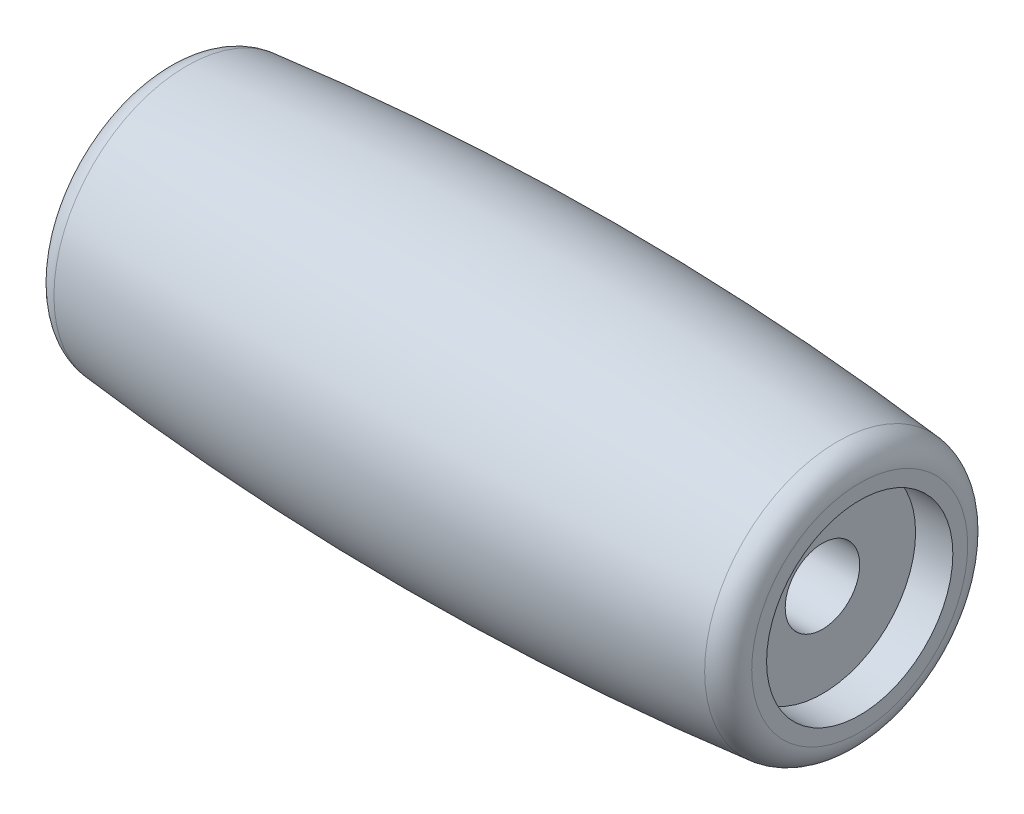
ISO-10303-21;
HEADER;
FILE_DESCRIPTION(('STEP AP214'),'2;1');
FILE_NAME('part.step','',(''),(''),'','','');
FILE_SCHEMA(('AUTOMOTIVE_DESIGN { 1 0 10303 214 1 1 1 1 }'));
ENDSEC;
DATA;
#1=APPLICATION_CONTEXT('core data for automotive mechanical design processes');
#2=APPLICATION_PROTOCOL_DEFINITION('international standard','automotive_design',2000,#1);
#3=PRODUCT_CONTEXT('',#1,'mechanical');
#4=PRODUCT('Part','Part','',(#3));
#5=PRODUCT_RELATED_PRODUCT_CATEGORY('part','',(#4));
#6=PRODUCT_DEFINITION_FORMATION('','',#4);
#7=PRODUCT_DEFINITION_CONTEXT('part definition',#1,'design');
#8=PRODUCT_DEFINITION('design','',#6,#7);
#9=PRODUCT_DEFINITION_SHAPE('','',#8);
#10=(LENGTH_UNIT() NAMED_UNIT(*) SI_UNIT(.MILLI.,.METRE.));
#11=(NAMED_UNIT(*) PLANE_ANGLE_UNIT() SI_UNIT($,.RADIAN.));
#12=(NAMED_UNIT(*) SI_UNIT($,.STERADIAN.) SOLID_ANGLE_UNIT());
#13=UNCERTAINTY_MEASURE_WITH_UNIT(LENGTH_MEASURE(1.E-05),#10,'distance_accuracy_value','');
#14=(GEOMETRIC_REPRESENTATION_CONTEXT(3) GLOBAL_UNCERTAINTY_ASSIGNED_CONTEXT((#13)) GLOBAL_UNIT_ASSIGNED_CONTEXT((#10,
#11,#12)) REPRESENTATION_CONTEXT('',''));
#15=CARTESIAN_POINT('',(0.,0.,0.));
#16=DIRECTION('',(0.,0.,1.));
#17=DIRECTION('',(1.,0.,0.));
#18=AXIS2_PLACEMENT_3D('',#15,#16,#17);
#19=CARTESIAN_POINT('',(28.,2.43438778166371E-13,0.));
#20=DIRECTION('',(1.,0.,0.));
#21=DIRECTION('',(0.,0.,-1.));
#22=AXIS2_PLACEMENT_3D('',#19,#20,#21);
#23=PLANE('',#22);
#24=CARTESIAN_POINT('',(28.,0.,0.));
#25=DIRECTION('',(-1.,0.,0.));
#26=DIRECTION('',(0.,0.,1.));
#27=AXIS2_PLACEMENT_3D('',#24,#25,#26);
#28=CIRCLE('',#27,7.5);
#29=CARTESIAN_POINT('',(28.,0.,7.5));
#30=VERTEX_POINT('',#29);
#31=EDGE_CURVE('E81',#30,#30,#28,.T.);
#32=ORIENTED_EDGE('',*,*,#31,.T.);
#33=EDGE_LOOP('',(#32));
#34=FACE_BOUND('',#33,.T.);
#35=CARTESIAN_POINT('',(28.,0.,0.));
#36=DIRECTION('',(-1.,0.,0.));
#37=DIRECTION('',(0.,0.,1.));
#38=AXIS2_PLACEMENT_3D('',#35,#36,#37);
#39=CIRCLE('',#38,8.69715333012776);
#40=CARTESIAN_POINT('',(28.,0.,8.69715333012776));
#41=VERTEX_POINT('',#40);
#42=EDGE_CURVE('E10',#41,#41,#39,.T.);
#43=ORIENTED_EDGE('',*,*,#42,.F.);
#44=EDGE_LOOP('',(#43));
#45=FACE_BOUND('',#44,.T.);
#46=ADVANCED_FACE('F38',(#34,#45),#23,.T.);
#47=CARTESIAN_POINT('',(26.,0.,0.));
#48=DIRECTION('',(-1.,0.,0.));
#49=DIRECTION('',(0.,0.,1.));
#50=AXIS2_PLACEMENT_3D('',#47,#48,#49);
#51=TOROIDAL_SURFACE('',#50,8.69715333012776,2.00000000000003);
#52=CARTESIAN_POINT('',(26.199935917975,0.,0.));
#53=DIRECTION('',(-1.,0.,0.));
#54=DIRECTION('',(0.,0.,1.));
#55=AXIS2_PLACEMENT_3D('',#52,#53,#54);
#56=CIRCLE('',#55,10.6871346437847);
#57=CARTESIAN_POINT('',(26.199935917975,0.,10.6871346437847));
#58=VERTEX_POINT('',#57);
#59=EDGE_CURVE('E45',#58,#58,#56,.T.);
#60=ORIENTED_EDGE('',*,*,#59,.F.);
#61=EDGE_LOOP('',(#60));
#62=FACE_BOUND('',#61,.T.);
#63=ORIENTED_EDGE('',*,*,#42,.T.);
#64=EDGE_LOOP('',(#63));
#65=FACE_BOUND('',#64,.T.);
#66=ADVANCED_FACE('F100',(#62,#65),#51,.T.);
#67=CARTESIAN_POINT('',(0.,0.,0.));
#68=DIRECTION('',(-1.,0.,0.));
#69=DIRECTION('',(0.,0.,1.));
#70=AXIS2_PLACEMENT_3D('',#67,#68,#69);
#71=DEGENERATE_TOROIDAL_SURFACE('',#70,250.083333333333,262.083333333333,.F.);
#72=ORIENTED_EDGE('',*,*,#59,.T.);
#73=EDGE_LOOP('',(#72));
#74=FACE_BOUND('',#73,.T.);
#75=CARTESIAN_POINT('',(-26.199935917975,0.,0.));
#76=DIRECTION('',(-1.,0.,0.));
#77=DIRECTION('',(0.,0.,1.));
#78=AXIS2_PLACEMENT_3D('',#75,#76,#77);
#79=CIRCLE('',#78,10.6871346437847);
#80=CARTESIAN_POINT('',(-26.199935917975,0.,10.6871346437847));
#81=VERTEX_POINT('',#80);
#82=EDGE_CURVE('E50',#81,#81,#79,.T.);
#83=ORIENTED_EDGE('',*,*,#82,.F.);
#84=EDGE_LOOP('',(#83));
#85=FACE_BOUND('',#84,.T.);
#86=ADVANCED_FACE('F104',(#74,#85),#71,.F.);
#87=CARTESIAN_POINT('',(-26.,0.,0.));
#88=DIRECTION('',(-1.,0.,0.));
#89=DIRECTION('',(0.,0.,1.));
#90=AXIS2_PLACEMENT_3D('',#87,#88,#89);
#91=TOROIDAL_SURFACE('',#90,8.69715333012776,2.00000000000003);
#92=ORIENTED_EDGE('',*,*,#82,.T.);
#93=EDGE_LOOP('',(#92));
#94=FACE_BOUND('',#93,.T.);
#95=CARTESIAN_POINT('',(-28.,0.,0.));
#96=DIRECTION('',(-1.,0.,0.));
#97=DIRECTION('',(0.,0.,1.));
#98=AXIS2_PLACEMENT_3D('',#95,#96,#97);
#99=CIRCLE('',#98,8.69715333012776);
#100=CARTESIAN_POINT('',(-28.,0.,8.69715333012776));
#101=VERTEX_POINT('',#100);
#102=EDGE_CURVE('E55',#101,#101,#99,.T.);
#103=ORIENTED_EDGE('',*,*,#102,.F.);
#104=EDGE_LOOP('',(#103));
#105=FACE_BOUND('',#104,.T.);
#106=ADVANCED_FACE('F109',(#94,#105),#91,.T.);
#107=CARTESIAN_POINT('',(-28.,2.43438778166371E-13,0.));
#108=DIRECTION('',(1.,0.,0.));
#109=DIRECTION('',(0.,0.,-1.));
#110=AXIS2_PLACEMENT_3D('',#107,#108,#109);
#111=PLANE('',#110);
#112=CARTESIAN_POINT('',(-28.,0.,0.));
#113=DIRECTION('',(-1.,0.,0.));
#114=DIRECTION('',(0.,0.,1.));
#115=AXIS2_PLACEMENT_3D('',#112,#113,#114);
#116=CIRCLE('',#115,7.5);
#117=CARTESIAN_POINT('',(-28.,0.,7.5));
#118=VERTEX_POINT('',#117);
#119=EDGE_CURVE('E61',#118,#118,#116,.T.);
#120=ORIENTED_EDGE('',*,*,#119,.F.);
#121=EDGE_LOOP('',(#120));
#122=FACE_BOUND('',#121,.T.);
#123=ORIENTED_EDGE('',*,*,#102,.T.);
#124=EDGE_LOOP('',(#123));
#125=FACE_BOUND('',#124,.T.);
#126=ADVANCED_FACE('F114',(#122,#125),#111,.F.);
#127=CARTESIAN_POINT('',(-28.,0.,0.));
#128=DIRECTION('',(-1.,0.,0.));
#129=DIRECTION('',(0.,0.,1.));
#130=AXIS2_PLACEMENT_3D('',#127,#128,#129);
#131=CYLINDRICAL_SURFACE('',#130,7.5);
#132=CARTESIAN_POINT('',(-25.,0.,0.));
#133=DIRECTION('',(-1.,0.,0.));
#134=DIRECTION('',(0.,0.,1.));
#135=AXIS2_PLACEMENT_3D('',#132,#133,#134);
#136=CIRCLE('',#135,7.50000000000001);
#137=CARTESIAN_POINT('',(-25.,0.,7.50000000000001));
#138=VERTEX_POINT('',#137);
#139=EDGE_CURVE('E65',#138,#138,#136,.T.);
#140=ORIENTED_EDGE('',*,*,#139,.F.);
#141=EDGE_LOOP('',(#140));
#142=FACE_BOUND('',#141,.T.);
#143=ORIENTED_EDGE('',*,*,#119,.T.);
#144=EDGE_LOOP('',(#143));
#145=FACE_BOUND('',#144,.T.);
#146=ADVANCED_FACE('F118',(#142,#145),#131,.F.);
#147=CARTESIAN_POINT('',(-25.,0.,0.));
#148=DIRECTION('',(1.,0.,0.));
#149=DIRECTION('',(0.,0.,-1.));
#150=AXIS2_PLACEMENT_3D('',#147,#148,#149);
#151=PLANE('',#150);
#152=CARTESIAN_POINT('',(-25.,0.,0.));
#153=DIRECTION('',(-1.,0.,0.));
#154=DIRECTION('',(0.,0.,1.));
#155=AXIS2_PLACEMENT_3D('',#152,#153,#154);
#156=CIRCLE('',#155,3.);
#157=CARTESIAN_POINT('',(-25.,0.,3.));
#158=VERTEX_POINT('',#157);
#159=EDGE_CURVE('E69',#158,#158,#156,.T.);
#160=ORIENTED_EDGE('',*,*,#159,.F.);
#161=EDGE_LOOP('',(#160));
#162=FACE_BOUND('',#161,.T.);
#163=ORIENTED_EDGE('',*,*,#139,.T.);
#164=EDGE_LOOP('',(#163));
#165=FACE_BOUND('',#164,.T.);
#166=ADVANCED_FACE('F122',(#162,#165),#151,.F.);
#167=CARTESIAN_POINT('',(-28.,0.,0.));
#168=DIRECTION('',(-1.,0.,0.));
#169=DIRECTION('',(0.,0.,1.));
#170=AXIS2_PLACEMENT_3D('',#167,#168,#169);
#171=CYLINDRICAL_SURFACE('',#170,3.);
#172=CARTESIAN_POINT('',(25.,0.,0.));
#173=DIRECTION('',(-1.,0.,0.));
#174=DIRECTION('',(0.,0.,1.));
#175=AXIS2_PLACEMENT_3D('',#172,#173,#174);
#176=CIRCLE('',#175,3.);
#177=CARTESIAN_POINT('',(25.,0.,3.));
#178=VERTEX_POINT('',#177);
#179=EDGE_CURVE('E73',#178,#178,#176,.T.);
#180=ORIENTED_EDGE('',*,*,#179,.F.);
#181=EDGE_LOOP('',(#180));
#182=FACE_BOUND('',#181,.T.);
#183=ORIENTED_EDGE('',*,*,#159,.T.);
#184=EDGE_LOOP('',(#183));
#185=FACE_BOUND('',#184,.T.);
#186=ADVANCED_FACE('F96',(#182,#185),#171,.F.);
#187=CARTESIAN_POINT('',(25.,0.,0.));
#188=DIRECTION('',(1.,0.,0.));
#189=DIRECTION('',(0.,0.,-1.));
#190=AXIS2_PLACEMENT_3D('',#187,#188,#189);
#191=PLANE('',#190);
#192=ORIENTED_EDGE('',*,*,#179,.T.);
#193=EDGE_LOOP('',(#192));
#194=FACE_BOUND('',#193,.T.);
#195=CARTESIAN_POINT('',(25.,0.,0.));
#196=DIRECTION('',(-1.,0.,0.));
#197=DIRECTION('',(0.,0.,1.));
#198=AXIS2_PLACEMENT_3D('',#195,#196,#197);
#199=CIRCLE('',#198,7.50000000000001);
#200=CARTESIAN_POINT('',(25.,0.,7.50000000000001));
#201=VERTEX_POINT('',#200);
#202=EDGE_CURVE('E77',#201,#201,#199,.T.);
#203=ORIENTED_EDGE('',*,*,#202,.F.);
#204=EDGE_LOOP('',(#203));
#205=FACE_BOUND('',#204,.T.);
#206=ADVANCED_FACE('F90',(#194,#205),#191,.T.);
#207=CARTESIAN_POINT('',(-28.,0.,0.));
#208=DIRECTION('',(-1.,0.,0.));
#209=DIRECTION('',(0.,0.,1.));
#210=AXIS2_PLACEMENT_3D('',#207,#208,#209);
#211=CYLINDRICAL_SURFACE('',#210,7.5);
#212=ORIENTED_EDGE('',*,*,#202,.T.);
#213=EDGE_LOOP('',(#212));
#214=FACE_BOUND('',#213,.T.);
#215=ORIENTED_EDGE('',*,*,#31,.F.);
#216=EDGE_LOOP('',(#215));
#217=FACE_BOUND('',#216,.T.);
#218=ADVANCED_FACE('F88',(#214,#217),#211,.F.);
#219=CLOSED_SHELL('',(#46,#66,#86,#106,#126,#146,#166,#186,#206,#218));
#220=MANIFOLD_SOLID_BREP('B2',#219);
#221=ADVANCED_BREP_SHAPE_REPRESENTATION('',(#18,#220),#14);
#222=SHAPE_DEFINITION_REPRESENTATION(#9,#221);
ENDSEC;
END-ISO-10303-21;
